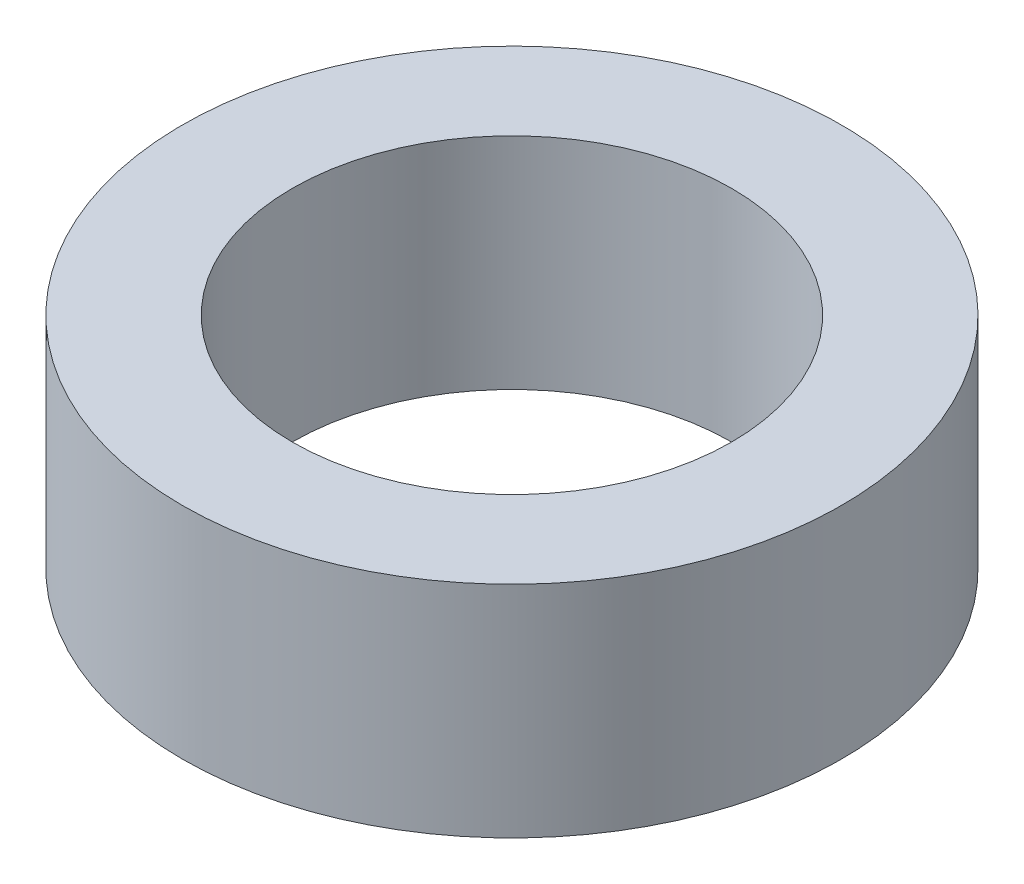
ISO-10303-21;
HEADER;
FILE_DESCRIPTION(('STEP AP214'),'2;1');
FILE_NAME('part.step','',(''),(''),'','','');
FILE_SCHEMA(('AUTOMOTIVE_DESIGN { 1 0 10303 214 1 1 1 1 }'));
ENDSEC;
DATA;
#1=APPLICATION_CONTEXT('core data for automotive mechanical design processes');
#2=APPLICATION_PROTOCOL_DEFINITION('international standard','automotive_design',2000,#1);
#3=PRODUCT_CONTEXT('',#1,'mechanical');
#4=PRODUCT('Part','Part','',(#3));
#5=PRODUCT_RELATED_PRODUCT_CATEGORY('part','',(#4));
#6=PRODUCT_DEFINITION_FORMATION('','',#4);
#7=PRODUCT_DEFINITION_CONTEXT('part definition',#1,'design');
#8=PRODUCT_DEFINITION('design','',#6,#7);
#9=PRODUCT_DEFINITION_SHAPE('','',#8);
#10=(LENGTH_UNIT() NAMED_UNIT(*) SI_UNIT(.MILLI.,.METRE.));
#11=(NAMED_UNIT(*) PLANE_ANGLE_UNIT() SI_UNIT($,.RADIAN.));
#12=(NAMED_UNIT(*) SI_UNIT($,.STERADIAN.) SOLID_ANGLE_UNIT());
#13=UNCERTAINTY_MEASURE_WITH_UNIT(LENGTH_MEASURE(1.E-05),#10,'distance_accuracy_value','');
#14=(GEOMETRIC_REPRESENTATION_CONTEXT(3) GLOBAL_UNCERTAINTY_ASSIGNED_CONTEXT((#13)) GLOBAL_UNIT_ASSIGNED_CONTEXT((#10,
#11,#12)) REPRESENTATION_CONTEXT('',''));
#15=CARTESIAN_POINT('',(0.,0.,0.));
#16=DIRECTION('',(0.,0.,1.));
#17=DIRECTION('',(1.,0.,0.));
#18=AXIS2_PLACEMENT_3D('',#15,#16,#17);
#19=CARTESIAN_POINT('',(0.,6.35,0.));
#20=DIRECTION('',(0.,1.,0.));
#21=DIRECTION('',(0.,0.,1.));
#22=AXIS2_PLACEMENT_3D('',#19,#20,#21);
#23=PLANE('',#22);
#24=CARTESIAN_POINT('',(0.,6.35,0.));
#25=DIRECTION('',(0.,1.,0.));
#26=DIRECTION('',(0.,0.,1.));
#27=AXIS2_PLACEMENT_3D('',#24,#25,#26);
#28=CIRCLE('',#27,9.525);
#29=CARTESIAN_POINT('',(0.,6.35,9.525));
#30=VERTEX_POINT('',#29);
#31=EDGE_CURVE('E10',#30,#30,#28,.T.);
#32=ORIENTED_EDGE('',*,*,#31,.T.);
#33=EDGE_LOOP('',(#32));
#34=FACE_BOUND('',#33,.T.);
#35=CARTESIAN_POINT('',(0.,6.35,0.));
#36=DIRECTION('',(0.,1.,0.));
#37=DIRECTION('',(0.,0.,1.));
#38=AXIS2_PLACEMENT_3D('',#35,#36,#37);
#39=CIRCLE('',#38,6.35);
#40=CARTESIAN_POINT('',(0.,6.35,6.35));
#41=VERTEX_POINT('',#40);
#42=EDGE_CURVE('E42',#41,#41,#39,.T.);
#43=ORIENTED_EDGE('',*,*,#42,.F.);
#44=EDGE_LOOP('',(#43));
#45=FACE_BOUND('',#44,.T.);
#46=ADVANCED_FACE('F31',(#34,#45),#23,.T.);
#47=CARTESIAN_POINT('',(0.,0.,0.));
#48=DIRECTION('',(0.,1.,0.));
#49=DIRECTION('',(0.,0.,1.));
#50=AXIS2_PLACEMENT_3D('',#47,#48,#49);
#51=PLANE('',#50);
#52=CARTESIAN_POINT('',(0.,0.,0.));
#53=DIRECTION('',(0.,1.,0.));
#54=DIRECTION('',(0.,0.,1.));
#55=AXIS2_PLACEMENT_3D('',#52,#53,#54);
#56=CIRCLE('',#55,9.525);
#57=CARTESIAN_POINT('',(0.,0.,9.525));
#58=VERTEX_POINT('',#57);
#59=EDGE_CURVE('E35',#58,#58,#56,.T.);
#60=ORIENTED_EDGE('',*,*,#59,.F.);
#61=EDGE_LOOP('',(#60));
#62=FACE_BOUND('',#61,.T.);
#63=CARTESIAN_POINT('',(0.,0.,0.));
#64=DIRECTION('',(0.,1.,0.));
#65=DIRECTION('',(0.,0.,1.));
#66=AXIS2_PLACEMENT_3D('',#63,#64,#65);
#67=CIRCLE('',#66,6.35);
#68=CARTESIAN_POINT('',(0.,0.,6.35));
#69=VERTEX_POINT('',#68);
#70=EDGE_CURVE('E44',#69,#69,#67,.T.);
#71=ORIENTED_EDGE('',*,*,#70,.T.);
#72=EDGE_LOOP('',(#71));
#73=FACE_BOUND('',#72,.T.);
#74=ADVANCED_FACE('F54',(#62,#73),#51,.F.);
#75=CARTESIAN_POINT('',(0.,6.35,0.));
#76=DIRECTION('',(0.,-1.,0.));
#77=DIRECTION('',(0.,0.,-1.));
#78=AXIS2_PLACEMENT_3D('',#75,#76,#77);
#79=CYLINDRICAL_SURFACE('',#78,9.525);
#80=ORIENTED_EDGE('',*,*,#31,.F.);
#81=EDGE_LOOP('',(#80));
#82=FACE_BOUND('',#81,.T.);
#83=ORIENTED_EDGE('',*,*,#59,.T.);
#84=EDGE_LOOP('',(#83));
#85=FACE_BOUND('',#84,.T.);
#86=ADVANCED_FACE('F33',(#82,#85),#79,.T.);
#87=CARTESIAN_POINT('',(0.,6.35,0.));
#88=DIRECTION('',(0.,-1.,0.));
#89=DIRECTION('',(0.,0.,-1.));
#90=AXIS2_PLACEMENT_3D('',#87,#88,#89);
#91=CYLINDRICAL_SURFACE('',#90,6.35);
#92=ORIENTED_EDGE('',*,*,#42,.T.);
#93=EDGE_LOOP('',(#92));
#94=FACE_BOUND('',#93,.T.);
#95=ORIENTED_EDGE('',*,*,#70,.F.);
#96=EDGE_LOOP('',(#95));
#97=FACE_BOUND('',#96,.T.);
#98=ADVANCED_FACE('F50',(#94,#97),#91,.F.);
#99=CLOSED_SHELL('',(#46,#74,#86,#98));
#100=MANIFOLD_SOLID_BREP('B2',#99);
#101=ADVANCED_BREP_SHAPE_REPRESENTATION('',(#18,#100),#14);
#102=SHAPE_DEFINITION_REPRESENTATION(#9,#101);
ENDSEC;
END-ISO-10303-21;
